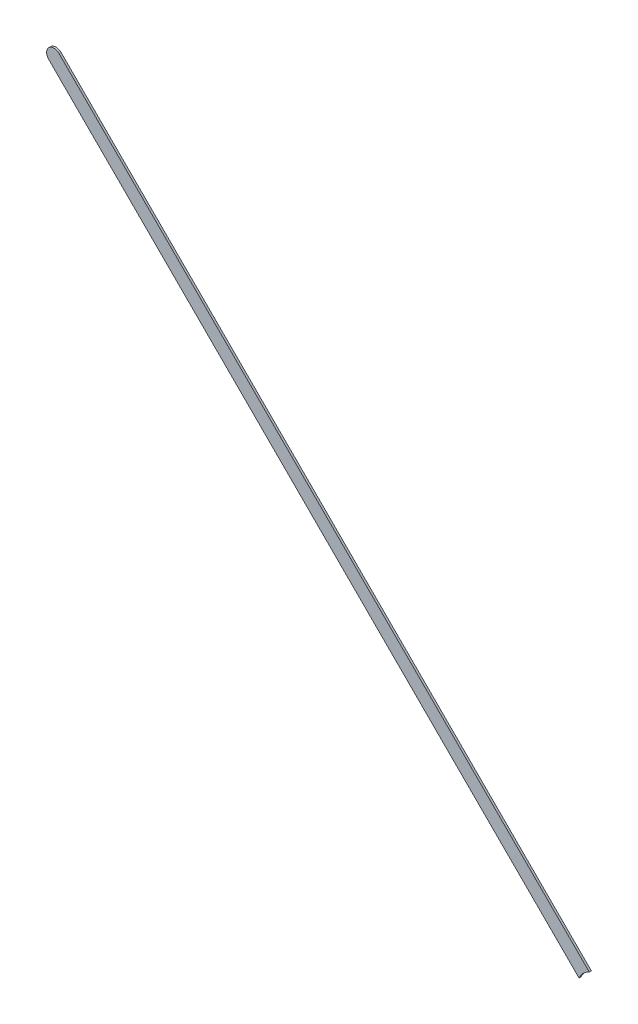
ISO-10303-21;
HEADER;
FILE_DESCRIPTION(('STEP AP214'),'2;1');
FILE_NAME('part.step','',(''),(''),'','','');
FILE_SCHEMA(('AUTOMOTIVE_DESIGN { 1 0 10303 214 1 1 1 1 }'));
ENDSEC;
DATA;
#1=APPLICATION_CONTEXT('core data for automotive mechanical design processes');
#2=APPLICATION_PROTOCOL_DEFINITION('international standard','automotive_design',2000,#1);
#3=PRODUCT_CONTEXT('',#1,'mechanical');
#4=PRODUCT('Part','Part','',(#3));
#5=PRODUCT_RELATED_PRODUCT_CATEGORY('part','',(#4));
#6=PRODUCT_DEFINITION_FORMATION('','',#4);
#7=PRODUCT_DEFINITION_CONTEXT('part definition',#1,'design');
#8=PRODUCT_DEFINITION('design','',#6,#7);
#9=PRODUCT_DEFINITION_SHAPE('','',#8);
#10=(LENGTH_UNIT() NAMED_UNIT(*) SI_UNIT(.MILLI.,.METRE.));
#11=(NAMED_UNIT(*) PLANE_ANGLE_UNIT() SI_UNIT($,.RADIAN.));
#12=(NAMED_UNIT(*) SI_UNIT($,.STERADIAN.) SOLID_ANGLE_UNIT());
#13=UNCERTAINTY_MEASURE_WITH_UNIT(LENGTH_MEASURE(1.E-05),#10,'distance_accuracy_value','');
#14=(GEOMETRIC_REPRESENTATION_CONTEXT(3) GLOBAL_UNCERTAINTY_ASSIGNED_CONTEXT((#13)) GLOBAL_UNIT_ASSIGNED_CONTEXT((#10,
#11,#12)) REPRESENTATION_CONTEXT('',''));
#15=CARTESIAN_POINT('',(0.,0.,0.));
#16=DIRECTION('',(0.,0.,1.));
#17=DIRECTION('',(1.,0.,0.));
#18=AXIS2_PLACEMENT_3D('',#15,#16,#17);
#19=CARTESIAN_POINT('',(75.42717198,76.09717064,0.));
#20=DIRECTION('',(0.707106781186548,0.707106781186548,0.));
#21=DIRECTION('',(0.707106781186548,-0.707106781186548,0.));
#22=AXIS2_PLACEMENT_3D('',#19,#20,#21);
#23=PLANE('',#22);
#24=DIRECTION('',(0.707106781186548,-0.707106781186548,0.));
#25=VECTOR('',#24,1.);
#26=CARTESIAN_POINT('',(75.42717198,76.09717064,0.03556));
#27=LINE('',#26,#25);
#28=CARTESIAN_POINT('',(75.42717198,76.09717064,0.03556));
#29=VERTEX_POINT('',#28);
#30=CARTESIAN_POINT('',(84.6923062571965,66.8320363628035,0.03556));
#31=VERTEX_POINT('',#30);
#32=EDGE_CURVE('E11',#29,#31,#27,.T.);
#33=ORIENTED_EDGE('',*,*,#32,.F.);
#34=DIRECTION('',(0.,0.,1.));
#35=VECTOR('',#34,1.);
#36=CARTESIAN_POINT('',(75.42717198,76.09717064,0.));
#37=LINE('',#36,#35);
#38=CARTESIAN_POINT('',(75.42717198,76.09717064,0.));
#39=VERTEX_POINT('',#38);
#40=EDGE_CURVE('E24',#39,#29,#37,.T.);
#41=ORIENTED_EDGE('',*,*,#40,.F.);
#42=DIRECTION('',(0.707106781186548,-0.707106781186548,0.));
#43=VECTOR('',#42,1.);
#44=CARTESIAN_POINT('',(75.42717198,76.09717064,0.));
#45=LINE('',#44,#43);
#46=CARTESIAN_POINT('',(84.6923062571965,66.8320363628035,0.));
#47=VERTEX_POINT('',#46);
#48=EDGE_CURVE('E75',#39,#47,#45,.T.);
#49=ORIENTED_EDGE('',*,*,#48,.T.);
#50=DIRECTION('',(0.,0.,1.));
#51=VECTOR('',#50,1.);
#52=CARTESIAN_POINT('',(84.6923062571965,66.8320363628035,0.));
#53=LINE('',#52,#51);
#54=EDGE_CURVE('E37',#47,#31,#53,.T.);
#55=ORIENTED_EDGE('',*,*,#54,.T.);
#56=EDGE_LOOP('',(#33,#41,#49,#55));
#57=FACE_BOUND('',#56,.T.);
#58=ADVANCED_FACE('F17',(#57),#23,.F.);
#59=CARTESIAN_POINT('',(85.01697246,66.68697356,0.));
#60=DIRECTION('',(0.,0.,-1.));
#61=DIRECTION('',(1.,0.,0.));
#62=AXIS2_PLACEMENT_3D('',#59,#60,#61);
#63=CYLINDRICAL_SURFACE('',#62,0.3556);
#64=DIRECTION('',(0.,0.,1.));
#65=VECTOR('',#64,1.);
#66=CARTESIAN_POINT('',(84.8719114127918,67.0116405472082,0.));
#67=LINE('',#66,#65);
#68=CARTESIAN_POINT('',(84.8719114127918,67.0116405472082,0.));
#69=VERTEX_POINT('',#68);
#70=CARTESIAN_POINT('',(84.8719114127918,67.0116405472082,0.03556));
#71=VERTEX_POINT('',#70);
#72=EDGE_CURVE('E67',#69,#71,#67,.T.);
#73=ORIENTED_EDGE('',*,*,#72,.T.);
#74=CARTESIAN_POINT('',(85.01697246,66.68697356,0.03556));
#75=DIRECTION('',(0.,0.,1.));
#76=DIRECTION('',(1.,0.,0.));
#77=AXIS2_PLACEMENT_3D('',#74,#75,#76);
#78=CIRCLE('',#77,0.3556);
#79=EDGE_CURVE('E82',#71,#31,#78,.T.);
#80=ORIENTED_EDGE('',*,*,#79,.T.);
#81=ORIENTED_EDGE('',*,*,#54,.F.);
#82=CARTESIAN_POINT('',(85.01697246,66.68697356,0.));
#83=DIRECTION('',(0.,0.,1.));
#84=DIRECTION('',(1.,0.,0.));
#85=AXIS2_PLACEMENT_3D('',#82,#83,#84);
#86=CIRCLE('',#85,0.3556);
#87=EDGE_CURVE('E80',#69,#47,#86,.T.);
#88=ORIENTED_EDGE('',*,*,#87,.F.);
#89=EDGE_LOOP('',(#73,#80,#81,#88));
#90=FACE_BOUND('',#89,.T.);
#91=ADVANCED_FACE('F88',(#90),#63,.F.);
#92=CARTESIAN_POINT('',(84.8719114127918,67.0116405472082,0.));
#93=DIRECTION('',(-0.707106781186548,-0.707106781186547,0.));
#94=DIRECTION('',(-0.707106781186547,0.707106781186548,0.));
#95=AXIS2_PLACEMENT_3D('',#92,#93,#94);
#96=PLANE('',#95);
#97=DIRECTION('',(-0.707106781186547,0.707106781186548,0.));
#98=VECTOR('',#97,1.);
#99=CARTESIAN_POINT('',(85.10677416,66.7767778,0.03556));
#100=LINE('',#99,#98);
#101=CARTESIAN_POINT('',(75.60677792,76.27677404,0.03556));
#102=VERTEX_POINT('',#101);
#103=EDGE_CURVE('E71',#71,#102,#100,.T.);
#104=ORIENTED_EDGE('',*,*,#103,.F.);
#105=ORIENTED_EDGE('',*,*,#72,.F.);
#106=DIRECTION('',(-0.707106781186547,0.707106781186548,0.));
#107=VECTOR('',#106,1.);
#108=CARTESIAN_POINT('',(85.10677416,66.7767778,0.));
#109=LINE('',#108,#107);
#110=CARTESIAN_POINT('',(75.60677792,76.27677404,0.));
#111=VERTEX_POINT('',#110);
#112=EDGE_CURVE('E63',#69,#111,#109,.T.);
#113=ORIENTED_EDGE('',*,*,#112,.T.);
#114=DIRECTION('',(0.,0.,1.));
#115=VECTOR('',#114,1.);
#116=CARTESIAN_POINT('',(75.60677792,76.27677404,0.));
#117=LINE('',#116,#115);
#118=EDGE_CURVE('E53',#111,#102,#117,.T.);
#119=ORIENTED_EDGE('',*,*,#118,.T.);
#120=EDGE_LOOP('',(#104,#105,#113,#119));
#121=FACE_BOUND('',#120,.T.);
#122=ADVANCED_FACE('F66',(#121),#96,.F.);
#123=CARTESIAN_POINT('',(75.51697495,76.18697234,0.));
#124=DIRECTION('',(0.,0.,-1.));
#125=DIRECTION('',(0.707111781181515,0.707101781156225,0.));
#126=AXIS2_PLACEMENT_3D('',#123,#124,#125);
#127=CYLINDRICAL_SURFACE('',#126,0.126999680092946);
#128=CARTESIAN_POINT('',(75.51697495,76.18697234,0.03556));
#129=DIRECTION('',(0.,0.,1.));
#130=DIRECTION('',(0.707111781181515,0.707101781156225,0.));
#131=AXIS2_PLACEMENT_3D('',#128,#129,#130);
#132=CIRCLE('',#131,0.126999680092946);
#133=EDGE_CURVE('E59',#102,#29,#132,.T.);
#134=ORIENTED_EDGE('',*,*,#133,.F.);
#135=ORIENTED_EDGE('',*,*,#118,.F.);
#136=CARTESIAN_POINT('',(75.51697495,76.18697234,0.));
#137=DIRECTION('',(0.,0.,1.));
#138=DIRECTION('',(0.707111781181515,0.707101781156225,0.));
#139=AXIS2_PLACEMENT_3D('',#136,#137,#138);
#140=CIRCLE('',#139,0.126999680092946);
#141=EDGE_CURVE('E57',#111,#39,#140,.T.);
#142=ORIENTED_EDGE('',*,*,#141,.T.);
#143=ORIENTED_EDGE('',*,*,#40,.T.);
#144=EDGE_LOOP('',(#134,#135,#142,#143));
#145=FACE_BOUND('',#144,.T.);
#146=ADVANCED_FACE('F55',(#145),#127,.T.);
#147=CARTESIAN_POINT('',(75.42717198,76.09717064,0.));
#148=DIRECTION('',(0.,0.,-1.));
#149=DIRECTION('',(-1.,0.,0.));
#150=AXIS2_PLACEMENT_3D('',#147,#148,#149);
#151=PLANE('',#150);
#152=ORIENTED_EDGE('',*,*,#48,.F.);
#153=ORIENTED_EDGE('',*,*,#141,.F.);
#154=ORIENTED_EDGE('',*,*,#112,.F.);
#155=ORIENTED_EDGE('',*,*,#87,.T.);
#156=EDGE_LOOP('',(#152,#153,#154,#155));
#157=FACE_BOUND('',#156,.T.);
#158=ADVANCED_FACE('F74',(#157),#151,.T.);
#159=CARTESIAN_POINT('',(75.42717198,76.09717064,0.03556));
#160=DIRECTION('',(0.,0.,-1.));
#161=DIRECTION('',(-1.,0.,0.));
#162=AXIS2_PLACEMENT_3D('',#159,#160,#161);
#163=PLANE('',#162);
#164=ORIENTED_EDGE('',*,*,#133,.T.);
#165=ORIENTED_EDGE('',*,*,#32,.T.);
#166=ORIENTED_EDGE('',*,*,#79,.F.);
#167=ORIENTED_EDGE('',*,*,#103,.T.);
#168=EDGE_LOOP('',(#164,#165,#166,#167));
#169=FACE_BOUND('',#168,.T.);
#170=ADVANCED_FACE('F91',(#169),#163,.F.);
#171=CLOSED_SHELL('',(#58,#91,#122,#146,#158,#170));
#172=MANIFOLD_SOLID_BREP('B1',#171);
#173=ADVANCED_BREP_SHAPE_REPRESENTATION('',(#18,#172),#14);
#174=SHAPE_DEFINITION_REPRESENTATION(#9,#173);
ENDSEC;
END-ISO-10303-21;
